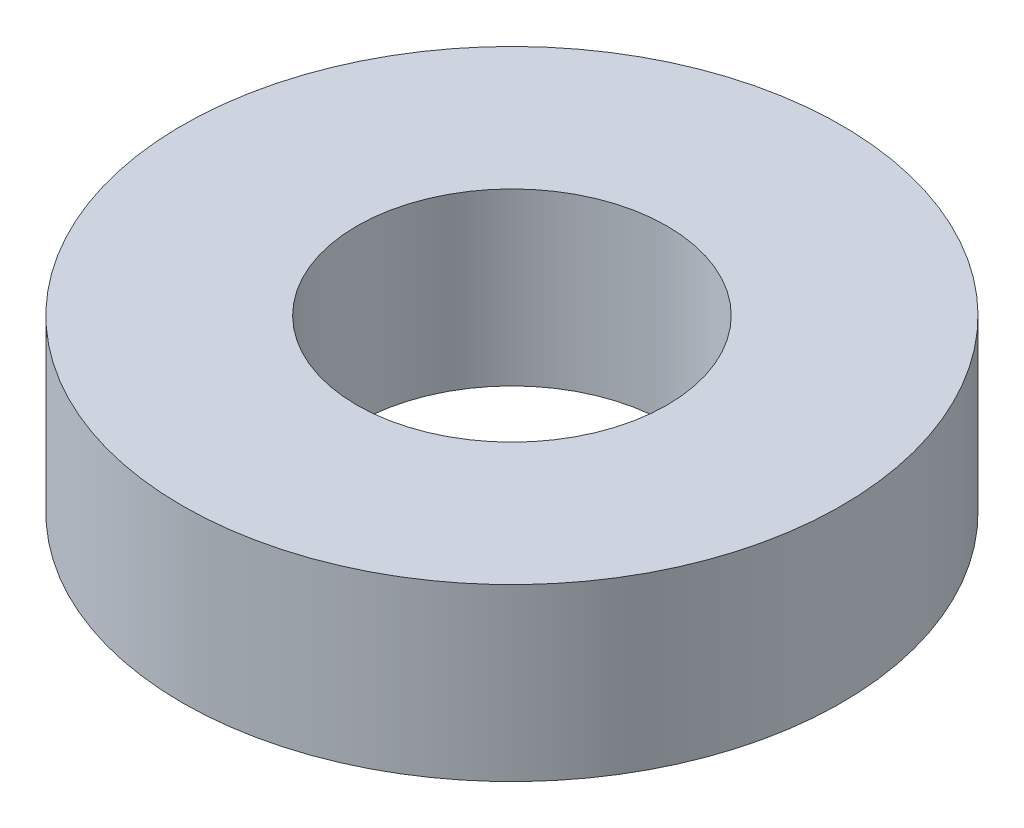
ISO-10303-21;
HEADER;
FILE_DESCRIPTION(('STEP AP214'),'2;1');
FILE_NAME('part.step','',(''),(''),'','','');
FILE_SCHEMA(('AUTOMOTIVE_DESIGN { 1 0 10303 214 1 1 1 1 }'));
ENDSEC;
DATA;
#1=APPLICATION_CONTEXT('core data for automotive mechanical design processes');
#2=APPLICATION_PROTOCOL_DEFINITION('international standard','automotive_design',2000,#1);
#3=PRODUCT_CONTEXT('',#1,'mechanical');
#4=PRODUCT('Part','Part','',(#3));
#5=PRODUCT_RELATED_PRODUCT_CATEGORY('part','',(#4));
#6=PRODUCT_DEFINITION_FORMATION('','',#4);
#7=PRODUCT_DEFINITION_CONTEXT('part definition',#1,'design');
#8=PRODUCT_DEFINITION('design','',#6,#7);
#9=PRODUCT_DEFINITION_SHAPE('','',#8);
#10=(LENGTH_UNIT() NAMED_UNIT(*) SI_UNIT(.MILLI.,.METRE.));
#11=(NAMED_UNIT(*) PLANE_ANGLE_UNIT() SI_UNIT($,.RADIAN.));
#12=(NAMED_UNIT(*) SI_UNIT($,.STERADIAN.) SOLID_ANGLE_UNIT());
#13=UNCERTAINTY_MEASURE_WITH_UNIT(LENGTH_MEASURE(1.E-05),#10,'distance_accuracy_value','');
#14=(GEOMETRIC_REPRESENTATION_CONTEXT(3) GLOBAL_UNCERTAINTY_ASSIGNED_CONTEXT((#13)) GLOBAL_UNIT_ASSIGNED_CONTEXT((#10,
#11,#12)) REPRESENTATION_CONTEXT('',''));
#15=CARTESIAN_POINT('',(0.,0.,0.));
#16=DIRECTION('',(0.,0.,1.));
#17=DIRECTION('',(1.,0.,0.));
#18=AXIS2_PLACEMENT_3D('',#15,#16,#17);
#19=CARTESIAN_POINT('',(0.,22.,0.));
#20=DIRECTION('',(0.,-1.,0.));
#21=DIRECTION('',(0.,0.,-1.));
#22=AXIS2_PLACEMENT_3D('',#19,#20,#21);
#23=CYLINDRICAL_SURFACE('',#22,42.5);
#24=CARTESIAN_POINT('',(0.,22.,0.));
#25=DIRECTION('',(0.,1.,0.));
#26=DIRECTION('',(0.,0.,1.));
#27=AXIS2_PLACEMENT_3D('',#24,#25,#26);
#28=CIRCLE('',#27,42.5);
#29=CARTESIAN_POINT('',(0.,22.,42.5));
#30=VERTEX_POINT('',#29);
#31=EDGE_CURVE('E10',#30,#30,#28,.T.);
#32=ORIENTED_EDGE('',*,*,#31,.F.);
#33=EDGE_LOOP('',(#32));
#34=FACE_BOUND('',#33,.T.);
#35=CARTESIAN_POINT('',(0.,0.,0.));
#36=DIRECTION('',(0.,1.,0.));
#37=DIRECTION('',(0.,0.,1.));
#38=AXIS2_PLACEMENT_3D('',#35,#36,#37);
#39=CIRCLE('',#38,42.5);
#40=CARTESIAN_POINT('',(0.,0.,42.5));
#41=VERTEX_POINT('',#40);
#42=EDGE_CURVE('E37',#41,#41,#39,.T.);
#43=ORIENTED_EDGE('',*,*,#42,.T.);
#44=EDGE_LOOP('',(#43));
#45=FACE_BOUND('',#44,.T.);
#46=ADVANCED_FACE('F40',(#34,#45),#23,.T.);
#47=CARTESIAN_POINT('',(0.,22.,0.));
#48=DIRECTION('',(0.,1.,0.));
#49=DIRECTION('',(0.,0.,1.));
#50=AXIS2_PLACEMENT_3D('',#47,#48,#49);
#51=PLANE('',#50);
#52=CARTESIAN_POINT('',(0.,22.,0.));
#53=DIRECTION('',(0.,1.,0.));
#54=DIRECTION('',(0.,0.,1.));
#55=AXIS2_PLACEMENT_3D('',#52,#53,#54);
#56=CIRCLE('',#55,20.);
#57=CARTESIAN_POINT('',(0.,22.,20.));
#58=VERTEX_POINT('',#57);
#59=EDGE_CURVE('E50',#58,#58,#56,.T.);
#60=ORIENTED_EDGE('',*,*,#59,.F.);
#61=EDGE_LOOP('',(#60));
#62=FACE_BOUND('',#61,.T.);
#63=ORIENTED_EDGE('',*,*,#31,.T.);
#64=EDGE_LOOP('',(#63));
#65=FACE_BOUND('',#64,.T.);
#66=ADVANCED_FACE('F59',(#62,#65),#51,.T.);
#67=CARTESIAN_POINT('',(0.,0.,0.));
#68=DIRECTION('',(0.,1.,0.));
#69=DIRECTION('',(0.,0.,1.));
#70=AXIS2_PLACEMENT_3D('',#67,#68,#69);
#71=PLANE('',#70);
#72=CARTESIAN_POINT('',(0.,0.,0.));
#73=DIRECTION('',(0.,1.,0.));
#74=DIRECTION('',(0.,0.,1.));
#75=AXIS2_PLACEMENT_3D('',#72,#73,#74);
#76=CIRCLE('',#75,20.);
#77=CARTESIAN_POINT('',(0.,0.,20.));
#78=VERTEX_POINT('',#77);
#79=EDGE_CURVE('E47',#78,#78,#76,.T.);
#80=ORIENTED_EDGE('',*,*,#79,.T.);
#81=EDGE_LOOP('',(#80));
#82=FACE_BOUND('',#81,.T.);
#83=ORIENTED_EDGE('',*,*,#42,.F.);
#84=EDGE_LOOP('',(#83));
#85=FACE_BOUND('',#84,.T.);
#86=ADVANCED_FACE('F58',(#82,#85),#71,.F.);
#87=CARTESIAN_POINT('',(0.,22.,0.));
#88=DIRECTION('',(0.,-1.,0.));
#89=DIRECTION('',(0.,0.,-1.));
#90=AXIS2_PLACEMENT_3D('',#87,#88,#89);
#91=CYLINDRICAL_SURFACE('',#90,20.);
#92=ORIENTED_EDGE('',*,*,#59,.T.);
#93=EDGE_LOOP('',(#92));
#94=FACE_BOUND('',#93,.T.);
#95=ORIENTED_EDGE('',*,*,#79,.F.);
#96=EDGE_LOOP('',(#95));
#97=FACE_BOUND('',#96,.T.);
#98=ADVANCED_FACE('F54',(#94,#97),#91,.F.);
#99=CLOSED_SHELL('',(#46,#66,#86,#98));
#100=MANIFOLD_SOLID_BREP('B2',#99);
#101=ADVANCED_BREP_SHAPE_REPRESENTATION('',(#18,#100),#14);
#102=SHAPE_DEFINITION_REPRESENTATION(#9,#101);
ENDSEC;
END-ISO-10303-21;
